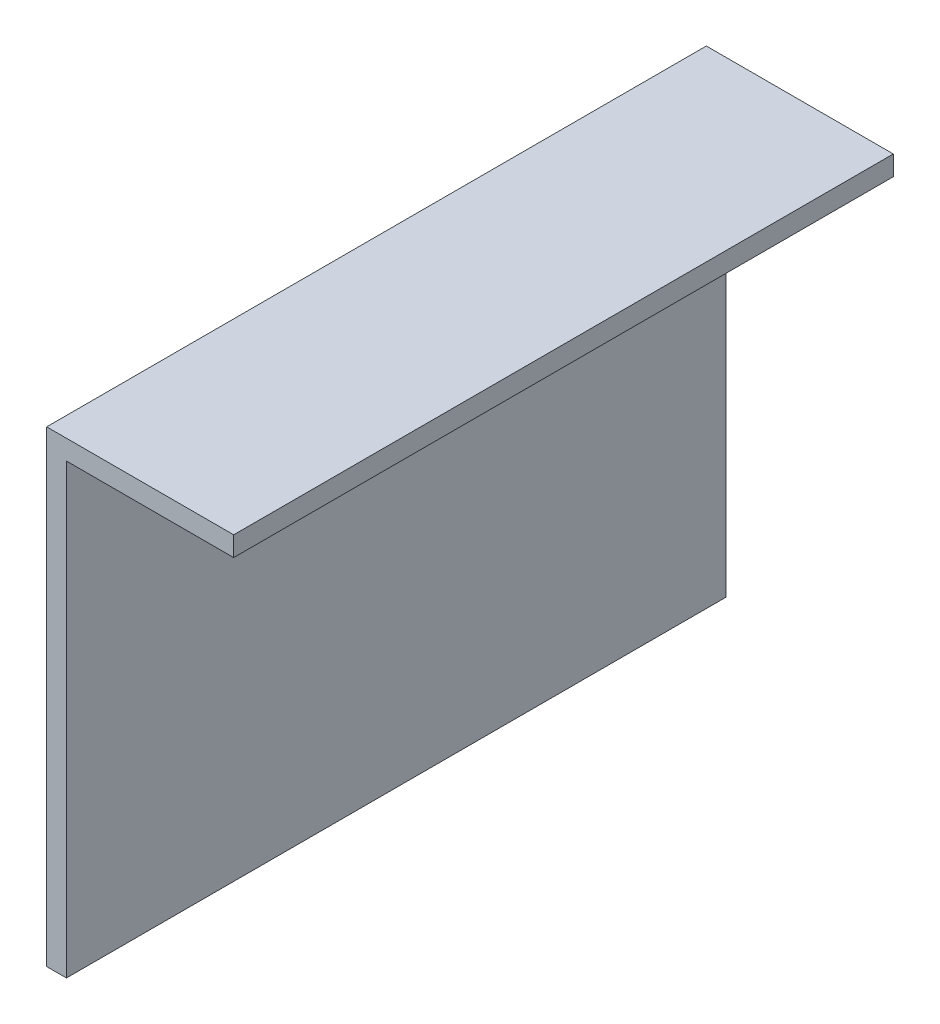
ISO-10303-21;
HEADER;
FILE_DESCRIPTION(('STEP AP214'),'2;1');
FILE_NAME('part.step','',(''),(''),'','','');
FILE_SCHEMA(('AUTOMOTIVE_DESIGN { 1 0 10303 214 1 1 1 1 }'));
ENDSEC;
DATA;
#1=APPLICATION_CONTEXT('core data for automotive mechanical design processes');
#2=APPLICATION_PROTOCOL_DEFINITION('international standard','automotive_design',2000,#1);
#3=PRODUCT_CONTEXT('',#1,'mechanical');
#4=PRODUCT('Part','Part','',(#3));
#5=PRODUCT_RELATED_PRODUCT_CATEGORY('part','',(#4));
#6=PRODUCT_DEFINITION_FORMATION('','',#4);
#7=PRODUCT_DEFINITION_CONTEXT('part definition',#1,'design');
#8=PRODUCT_DEFINITION('design','',#6,#7);
#9=PRODUCT_DEFINITION_SHAPE('','',#8);
#10=(LENGTH_UNIT() NAMED_UNIT(*) SI_UNIT(.MILLI.,.METRE.));
#11=(NAMED_UNIT(*) PLANE_ANGLE_UNIT() SI_UNIT($,.RADIAN.));
#12=(NAMED_UNIT(*) SI_UNIT($,.STERADIAN.) SOLID_ANGLE_UNIT());
#13=UNCERTAINTY_MEASURE_WITH_UNIT(LENGTH_MEASURE(1.E-05),#10,'distance_accuracy_value','');
#14=(GEOMETRIC_REPRESENTATION_CONTEXT(3) GLOBAL_UNCERTAINTY_ASSIGNED_CONTEXT((#13)) GLOBAL_UNIT_ASSIGNED_CONTEXT((#10,
#11,#12)) REPRESENTATION_CONTEXT('',''));
#15=CARTESIAN_POINT('',(0.,0.,0.));
#16=DIRECTION('',(0.,0.,1.));
#17=DIRECTION('',(1.,0.,0.));
#18=AXIS2_PLACEMENT_3D('',#15,#16,#17);
#19=CARTESIAN_POINT('',(1.9,0.,63.5));
#20=DIRECTION('',(0.,1.,0.));
#21=DIRECTION('',(0.,0.,1.));
#22=AXIS2_PLACEMENT_3D('',#19,#20,#21);
#23=PLANE('',#22);
#24=DIRECTION('',(1.,0.,0.));
#25=VECTOR('',#24,1.);
#26=CARTESIAN_POINT('',(1.9,0.,0.));
#27=LINE('',#26,#25);
#28=CARTESIAN_POINT('',(0.,0.,0.));
#29=VERTEX_POINT('',#28);
#30=CARTESIAN_POINT('',(1.9,0.,0.));
#31=VERTEX_POINT('',#30);
#32=EDGE_CURVE('E119',#29,#31,#27,.T.);
#33=ORIENTED_EDGE('',*,*,#32,.T.);
#34=DIRECTION('',(0.,0.,-1.));
#35=VECTOR('',#34,1.);
#36=CARTESIAN_POINT('',(1.9,0.,63.5));
#37=LINE('',#36,#35);
#38=CARTESIAN_POINT('',(1.9,0.,63.5));
#39=VERTEX_POINT('',#38);
#40=EDGE_CURVE('E11',#39,#31,#37,.T.);
#41=ORIENTED_EDGE('',*,*,#40,.F.);
#42=DIRECTION('',(1.,0.,0.));
#43=VECTOR('',#42,1.);
#44=CARTESIAN_POINT('',(1.9,0.,63.5));
#45=LINE('',#44,#43);
#46=CARTESIAN_POINT('',(0.,0.,63.5));
#47=VERTEX_POINT('',#46);
#48=EDGE_CURVE('E129',#47,#39,#45,.T.);
#49=ORIENTED_EDGE('',*,*,#48,.F.);
#50=DIRECTION('',(0.,0.,-1.));
#51=VECTOR('',#50,1.);
#52=CARTESIAN_POINT('',(0.,0.,63.5));
#53=LINE('',#52,#51);
#54=EDGE_CURVE('E115',#47,#29,#53,.T.);
#55=ORIENTED_EDGE('',*,*,#54,.T.);
#56=EDGE_LOOP('',(#33,#41,#49,#55));
#57=FACE_BOUND('',#56,.T.);
#58=ADVANCED_FACE('F35',(#57),#23,.F.);
#59=CARTESIAN_POINT('',(1.9,0.,63.5));
#60=DIRECTION('',(-1.,0.,0.));
#61=DIRECTION('',(0.,0.,1.));
#62=AXIS2_PLACEMENT_3D('',#59,#60,#61);
#63=PLANE('',#62);
#64=DIRECTION('',(0.,1.,0.));
#65=VECTOR('',#64,1.);
#66=CARTESIAN_POINT('',(1.9,0.,0.));
#67=LINE('',#66,#65);
#68=CARTESIAN_POINT('',(1.9,43.1,0.));
#69=VERTEX_POINT('',#68);
#70=EDGE_CURVE('E122',#31,#69,#67,.T.);
#71=ORIENTED_EDGE('',*,*,#70,.T.);
#72=DIRECTION('',(0.,0.,-1.));
#73=VECTOR('',#72,1.);
#74=CARTESIAN_POINT('',(1.9,43.1,63.5));
#75=LINE('',#74,#73);
#76=CARTESIAN_POINT('',(1.9,43.1,63.5));
#77=VERTEX_POINT('',#76);
#78=EDGE_CURVE('E43',#77,#69,#75,.T.);
#79=ORIENTED_EDGE('',*,*,#78,.F.);
#80=DIRECTION('',(0.,1.,0.));
#81=VECTOR('',#80,1.);
#82=CARTESIAN_POINT('',(1.9,0.,63.5));
#83=LINE('',#82,#81);
#84=EDGE_CURVE('E88',#39,#77,#83,.T.);
#85=ORIENTED_EDGE('',*,*,#84,.F.);
#86=ORIENTED_EDGE('',*,*,#40,.T.);
#87=EDGE_LOOP('',(#71,#79,#85,#86));
#88=FACE_BOUND('',#87,.T.);
#89=ADVANCED_FACE('F153',(#88),#63,.F.);
#90=CARTESIAN_POINT('',(1.9,43.1,63.5));
#91=DIRECTION('',(0.,1.,0.));
#92=DIRECTION('',(0.,0.,1.));
#93=AXIS2_PLACEMENT_3D('',#90,#91,#92);
#94=PLANE('',#93);
#95=DIRECTION('',(1.,0.,0.));
#96=VECTOR('',#95,1.);
#97=CARTESIAN_POINT('',(1.9,43.1,0.));
#98=LINE('',#97,#96);
#99=CARTESIAN_POINT('',(18.,43.1,0.));
#100=VERTEX_POINT('',#99);
#101=EDGE_CURVE('E124',#69,#100,#98,.T.);
#102=ORIENTED_EDGE('',*,*,#101,.T.);
#103=DIRECTION('',(0.,0.,-1.));
#104=VECTOR('',#103,1.);
#105=CARTESIAN_POINT('',(18.,43.1,63.5));
#106=LINE('',#105,#104);
#107=CARTESIAN_POINT('',(18.,43.1,63.5));
#108=VERTEX_POINT('',#107);
#109=EDGE_CURVE('E110',#108,#100,#106,.T.);
#110=ORIENTED_EDGE('',*,*,#109,.F.);
#111=DIRECTION('',(1.,0.,0.));
#112=VECTOR('',#111,1.);
#113=CARTESIAN_POINT('',(1.9,43.1,63.5));
#114=LINE('',#113,#112);
#115=EDGE_CURVE('E101',#77,#108,#114,.T.);
#116=ORIENTED_EDGE('',*,*,#115,.F.);
#117=ORIENTED_EDGE('',*,*,#78,.T.);
#118=EDGE_LOOP('',(#102,#110,#116,#117));
#119=FACE_BOUND('',#118,.T.);
#120=ADVANCED_FACE('F135',(#119),#94,.F.);
#121=CARTESIAN_POINT('',(18.,43.1,63.5));
#122=DIRECTION('',(-1.,0.,0.));
#123=DIRECTION('',(0.,0.,1.));
#124=AXIS2_PLACEMENT_3D('',#121,#122,#123);
#125=PLANE('',#124);
#126=DIRECTION('',(0.,1.,0.));
#127=VECTOR('',#126,1.);
#128=CARTESIAN_POINT('',(18.,43.1,0.));
#129=LINE('',#128,#127);
#130=CARTESIAN_POINT('',(18.,45.,0.));
#131=VERTEX_POINT('',#130);
#132=EDGE_CURVE('E109',#100,#131,#129,.T.);
#133=ORIENTED_EDGE('',*,*,#132,.T.);
#134=DIRECTION('',(0.,0.,-1.));
#135=VECTOR('',#134,1.);
#136=CARTESIAN_POINT('',(18.,45.,63.5));
#137=LINE('',#136,#135);
#138=CARTESIAN_POINT('',(18.,45.,63.5));
#139=VERTEX_POINT('',#138);
#140=EDGE_CURVE('E106',#139,#131,#137,.T.);
#141=ORIENTED_EDGE('',*,*,#140,.F.);
#142=DIRECTION('',(0.,1.,0.));
#143=VECTOR('',#142,1.);
#144=CARTESIAN_POINT('',(18.,43.1,63.5));
#145=LINE('',#144,#143);
#146=EDGE_CURVE('E95',#108,#139,#145,.T.);
#147=ORIENTED_EDGE('',*,*,#146,.F.);
#148=ORIENTED_EDGE('',*,*,#109,.T.);
#149=EDGE_LOOP('',(#133,#141,#147,#148));
#150=FACE_BOUND('',#149,.T.);
#151=ADVANCED_FACE('F107',(#150),#125,.F.);
#152=CARTESIAN_POINT('',(0.,45.,63.5));
#153=DIRECTION('',(0.,-1.,0.));
#154=DIRECTION('',(0.,0.,-1.));
#155=AXIS2_PLACEMENT_3D('',#152,#153,#154);
#156=PLANE('',#155);
#157=DIRECTION('',(-1.,0.,0.));
#158=VECTOR('',#157,1.);
#159=CARTESIAN_POINT('',(0.,45.,0.));
#160=LINE('',#159,#158);
#161=CARTESIAN_POINT('',(0.,45.,0.));
#162=VERTEX_POINT('',#161);
#163=EDGE_CURVE('E74',#131,#162,#160,.T.);
#164=ORIENTED_EDGE('',*,*,#163,.T.);
#165=DIRECTION('',(0.,0.,-1.));
#166=VECTOR('',#165,1.);
#167=CARTESIAN_POINT('',(0.,45.,63.5));
#168=LINE('',#167,#166);
#169=CARTESIAN_POINT('',(0.,45.,63.5));
#170=VERTEX_POINT('',#169);
#171=EDGE_CURVE('E111',#170,#162,#168,.T.);
#172=ORIENTED_EDGE('',*,*,#171,.F.);
#173=DIRECTION('',(-1.,0.,0.));
#174=VECTOR('',#173,1.);
#175=CARTESIAN_POINT('',(0.,45.,63.5));
#176=LINE('',#175,#174);
#177=EDGE_CURVE('E99',#139,#170,#176,.T.);
#178=ORIENTED_EDGE('',*,*,#177,.F.);
#179=ORIENTED_EDGE('',*,*,#140,.T.);
#180=EDGE_LOOP('',(#164,#172,#178,#179));
#181=FACE_BOUND('',#180,.T.);
#182=ADVANCED_FACE('F113',(#181),#156,.F.);
#183=CARTESIAN_POINT('',(0.,0.,63.5));
#184=DIRECTION('',(1.,0.,0.));
#185=DIRECTION('',(0.,0.,-1.));
#186=AXIS2_PLACEMENT_3D('',#183,#184,#185);
#187=PLANE('',#186);
#188=DIRECTION('',(0.,-1.,0.));
#189=VECTOR('',#188,1.);
#190=CARTESIAN_POINT('',(0.,0.,0.));
#191=LINE('',#190,#189);
#192=EDGE_CURVE('E80',#162,#29,#191,.T.);
#193=ORIENTED_EDGE('',*,*,#192,.T.);
#194=ORIENTED_EDGE('',*,*,#54,.F.);
#195=DIRECTION('',(0.,-1.,0.));
#196=VECTOR('',#195,1.);
#197=CARTESIAN_POINT('',(0.,0.,63.5));
#198=LINE('',#197,#196);
#199=EDGE_CURVE('E51',#170,#47,#198,.T.);
#200=ORIENTED_EDGE('',*,*,#199,.F.);
#201=ORIENTED_EDGE('',*,*,#171,.T.);
#202=EDGE_LOOP('',(#193,#194,#200,#201));
#203=FACE_BOUND('',#202,.T.);
#204=ADVANCED_FACE('F142',(#203),#187,.F.);
#205=CARTESIAN_POINT('',(0.,0.,63.5));
#206=DIRECTION('',(0.,0.,-1.));
#207=DIRECTION('',(-1.,0.,0.));
#208=AXIS2_PLACEMENT_3D('',#205,#206,#207);
#209=PLANE('',#208);
#210=ORIENTED_EDGE('',*,*,#48,.T.);
#211=ORIENTED_EDGE('',*,*,#84,.T.);
#212=ORIENTED_EDGE('',*,*,#115,.T.);
#213=ORIENTED_EDGE('',*,*,#146,.T.);
#214=ORIENTED_EDGE('',*,*,#177,.T.);
#215=ORIENTED_EDGE('',*,*,#199,.T.);
#216=EDGE_LOOP('',(#210,#211,#212,#213,#214,#215));
#217=FACE_BOUND('',#216,.T.);
#218=ADVANCED_FACE('F97',(#217),#209,.F.);
#219=CARTESIAN_POINT('',(0.,0.,0.));
#220=DIRECTION('',(0.,0.,-1.));
#221=DIRECTION('',(-1.,0.,0.));
#222=AXIS2_PLACEMENT_3D('',#219,#220,#221);
#223=PLANE('',#222);
#224=ORIENTED_EDGE('',*,*,#32,.F.);
#225=ORIENTED_EDGE('',*,*,#192,.F.);
#226=ORIENTED_EDGE('',*,*,#163,.F.);
#227=ORIENTED_EDGE('',*,*,#132,.F.);
#228=ORIENTED_EDGE('',*,*,#101,.F.);
#229=ORIENTED_EDGE('',*,*,#70,.F.);
#230=EDGE_LOOP('',(#224,#225,#226,#227,#228,#229));
#231=FACE_BOUND('',#230,.T.);
#232=ADVANCED_FACE('F138',(#231),#223,.T.);
#233=CLOSED_SHELL('',(#58,#89,#120,#151,#182,#204,#218,#232));
#234=MANIFOLD_SOLID_BREP('B2',#233);
#235=ADVANCED_BREP_SHAPE_REPRESENTATION('',(#18,#234),#14);
#236=SHAPE_DEFINITION_REPRESENTATION(#9,#235);
ENDSEC;
END-ISO-10303-21;
